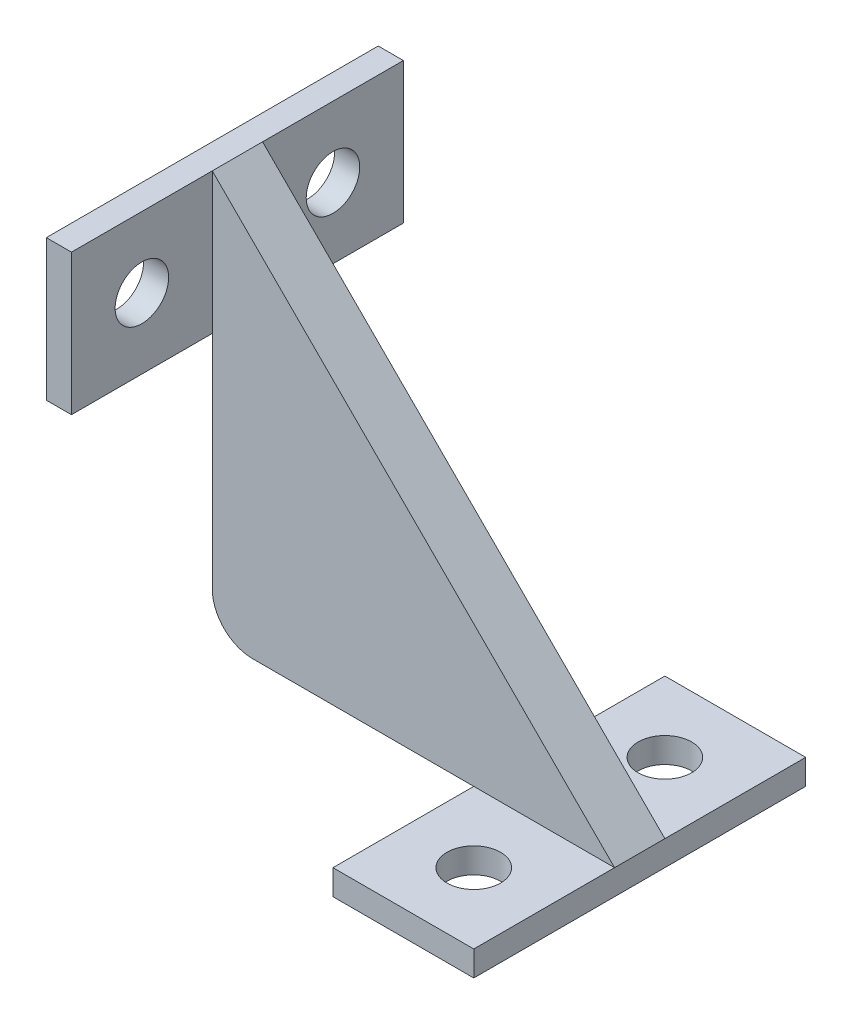
ISO-10303-21;
HEADER;
FILE_DESCRIPTION(('STEP AP214'),'2;1');
FILE_NAME('part.step','',(''),(''),'','','');
FILE_SCHEMA(('AUTOMOTIVE_DESIGN { 1 0 10303 214 1 1 1 1 }'));
ENDSEC;
DATA;
#1=APPLICATION_CONTEXT('core data for automotive mechanical design processes');
#2=APPLICATION_PROTOCOL_DEFINITION('international standard','automotive_design',2000,#1);
#3=PRODUCT_CONTEXT('',#1,'mechanical');
#4=PRODUCT('Part','Part','',(#3));
#5=PRODUCT_RELATED_PRODUCT_CATEGORY('part','',(#4));
#6=PRODUCT_DEFINITION_FORMATION('','',#4);
#7=PRODUCT_DEFINITION_CONTEXT('part definition',#1,'design');
#8=PRODUCT_DEFINITION('design','',#6,#7);
#9=PRODUCT_DEFINITION_SHAPE('','',#8);
#10=(LENGTH_UNIT() NAMED_UNIT(*) SI_UNIT(.MILLI.,.METRE.));
#11=(NAMED_UNIT(*) PLANE_ANGLE_UNIT() SI_UNIT($,.RADIAN.));
#12=(NAMED_UNIT(*) SI_UNIT($,.STERADIAN.) SOLID_ANGLE_UNIT());
#13=UNCERTAINTY_MEASURE_WITH_UNIT(LENGTH_MEASURE(1.E-05),#10,'distance_accuracy_value','');
#14=(GEOMETRIC_REPRESENTATION_CONTEXT(3) GLOBAL_UNCERTAINTY_ASSIGNED_CONTEXT((#13)) GLOBAL_UNIT_ASSIGNED_CONTEXT((#10,
#11,#12)) REPRESENTATION_CONTEXT('',''));
#15=CARTESIAN_POINT('',(0.,0.,0.));
#16=DIRECTION('',(0.,0.,1.));
#17=DIRECTION('',(1.,0.,0.));
#18=AXIS2_PLACEMENT_3D('',#15,#16,#17);
#19=CARTESIAN_POINT('',(50.8,0.,6.35));
#20=DIRECTION('',(0.,1.,0.));
#21=DIRECTION('',(-1.,0.,0.));
#22=AXIS2_PLACEMENT_3D('',#19,#20,#21);
#23=PLANE('',#22);
#24=DIRECTION('',(0.,0.,-1.));
#25=VECTOR('',#24,1.);
#26=CARTESIAN_POINT('',(33.02,0.,24.13));
#27=LINE('',#26,#25);
#28=CARTESIAN_POINT('',(33.02,0.,6.35));
#29=VERTEX_POINT('',#28);
#30=CARTESIAN_POINT('',(33.02,0.,0.));
#31=VERTEX_POINT('',#30);
#32=EDGE_CURVE('E59',#29,#31,#27,.T.);
#33=ORIENTED_EDGE('',*,*,#32,.F.);
#34=DIRECTION('',(1.,0.,0.));
#35=VECTOR('',#34,1.);
#36=CARTESIAN_POINT('',(50.8,0.,6.35));
#37=LINE('',#36,#35);
#38=CARTESIAN_POINT('',(5.08000000000004,0.,6.35));
#39=VERTEX_POINT('',#38);
#40=EDGE_CURVE('E225',#39,#29,#37,.T.);
#41=ORIENTED_EDGE('',*,*,#40,.F.);
#42=DIRECTION('',(0.,0.,-1.));
#43=VECTOR('',#42,1.);
#44=CARTESIAN_POINT('',(5.08000000000004,0.,6.35));
#45=LINE('',#44,#43);
#46=CARTESIAN_POINT('',(5.08000000000004,0.,0.));
#47=VERTEX_POINT('',#46);
#48=EDGE_CURVE('E239',#39,#47,#45,.T.);
#49=ORIENTED_EDGE('',*,*,#48,.T.);
#50=DIRECTION('',(1.,0.,0.));
#51=VECTOR('',#50,1.);
#52=CARTESIAN_POINT('',(50.8,0.,0.));
#53=LINE('',#52,#51);
#54=EDGE_CURVE('E219',#47,#31,#53,.T.);
#55=ORIENTED_EDGE('',*,*,#54,.T.);
#56=EDGE_LOOP('',(#33,#41,#49,#55));
#57=FACE_BOUND('',#56,.T.);
#58=ADVANCED_FACE('F44',(#57),#23,.F.);
#59=CARTESIAN_POINT('',(0.,5.08000000000004,6.35));
#60=DIRECTION('',(1.,0.,0.));
#61=DIRECTION('',(0.,0.,-1.));
#62=AXIS2_PLACEMENT_3D('',#59,#60,#61);
#63=PLANE('',#62);
#64=DIRECTION('',(0.,0.,1.));
#65=VECTOR('',#64,1.);
#66=CARTESIAN_POINT('',(0.,33.02,24.13));
#67=LINE('',#66,#65);
#68=CARTESIAN_POINT('',(0.,33.02,0.));
#69=VERTEX_POINT('',#68);
#70=CARTESIAN_POINT('',(0.,33.02,6.35));
#71=VERTEX_POINT('',#70);
#72=EDGE_CURVE('E199',#69,#71,#67,.T.);
#73=ORIENTED_EDGE('',*,*,#72,.F.);
#74=DIRECTION('',(0.,-1.,0.));
#75=VECTOR('',#74,1.);
#76=CARTESIAN_POINT('',(0.,5.08000000000004,0.));
#77=LINE('',#76,#75);
#78=CARTESIAN_POINT('',(0.,5.08000000000004,0.));
#79=VERTEX_POINT('',#78);
#80=EDGE_CURVE('E230',#69,#79,#77,.T.);
#81=ORIENTED_EDGE('',*,*,#80,.T.);
#82=DIRECTION('',(0.,0.,-1.));
#83=VECTOR('',#82,1.);
#84=CARTESIAN_POINT('',(0.,5.08000000000004,6.35));
#85=LINE('',#84,#83);
#86=CARTESIAN_POINT('',(0.,5.08000000000004,6.35));
#87=VERTEX_POINT('',#86);
#88=EDGE_CURVE('E52',#87,#79,#85,.T.);
#89=ORIENTED_EDGE('',*,*,#88,.F.);
#90=DIRECTION('',(0.,-1.,0.));
#91=VECTOR('',#90,1.);
#92=CARTESIAN_POINT('',(0.,5.08000000000004,6.35));
#93=LINE('',#92,#91);
#94=EDGE_CURVE('E218',#71,#87,#93,.T.);
#95=ORIENTED_EDGE('',*,*,#94,.F.);
#96=EDGE_LOOP('',(#73,#81,#89,#95));
#97=FACE_BOUND('',#96,.T.);
#98=ADVANCED_FACE('F299',(#97),#63,.F.);
#99=CARTESIAN_POINT('',(0.,50.8,6.35));
#100=DIRECTION('',(-0.707106781186548,-0.707106781186548,0.));
#101=DIRECTION('',(0.707106781186548,-0.707106781186548,0.));
#102=AXIS2_PLACEMENT_3D('',#99,#100,#101);
#103=PLANE('',#102);
#104=DIRECTION('',(-0.707106781186547,0.707106781186547,0.));
#105=VECTOR('',#104,1.);
#106=CARTESIAN_POINT('',(0.,50.8,0.));
#107=LINE('',#106,#105);
#108=CARTESIAN_POINT('',(50.8,0.,0.));
#109=VERTEX_POINT('',#108);
#110=CARTESIAN_POINT('',(0.,50.8,0.));
#111=VERTEX_POINT('',#110);
#112=EDGE_CURVE('E215',#109,#111,#107,.T.);
#113=ORIENTED_EDGE('',*,*,#112,.T.);
#114=DIRECTION('',(0.,0.,-1.));
#115=VECTOR('',#114,1.);
#116=CARTESIAN_POINT('',(0.,50.8,6.35));
#117=LINE('',#116,#115);
#118=CARTESIAN_POINT('',(0.,50.8,6.35));
#119=VERTEX_POINT('',#118);
#120=EDGE_CURVE('E11',#119,#111,#117,.T.);
#121=ORIENTED_EDGE('',*,*,#120,.F.);
#122=DIRECTION('',(-0.707106781186547,0.707106781186547,0.));
#123=VECTOR('',#122,1.);
#124=CARTESIAN_POINT('',(0.,50.8,6.35));
#125=LINE('',#124,#123);
#126=CARTESIAN_POINT('',(50.8,0.,6.35));
#127=VERTEX_POINT('',#126);
#128=EDGE_CURVE('E216',#127,#119,#125,.T.);
#129=ORIENTED_EDGE('',*,*,#128,.F.);
#130=DIRECTION('',(0.,0.,-1.));
#131=VECTOR('',#130,1.);
#132=CARTESIAN_POINT('',(50.8,0.,6.35));
#133=LINE('',#132,#131);
#134=EDGE_CURVE('E227',#127,#109,#133,.T.);
#135=ORIENTED_EDGE('',*,*,#134,.T.);
#136=EDGE_LOOP('',(#113,#121,#129,#135));
#137=FACE_BOUND('',#136,.T.);
#138=ADVANCED_FACE('F46',(#137),#103,.F.);
#139=CARTESIAN_POINT('',(5.08,5.08,6.35));
#140=DIRECTION('',(0.,0.,-1.));
#141=DIRECTION('',(-1.,0.,0.));
#142=AXIS2_PLACEMENT_3D('',#139,#140,#141);
#143=CYLINDRICAL_SURFACE('',#142,5.08);
#144=CARTESIAN_POINT('',(5.08,5.08,0.));
#145=DIRECTION('',(0.,0.,1.));
#146=DIRECTION('',(1.,0.,0.));
#147=AXIS2_PLACEMENT_3D('',#144,#145,#146);
#148=CIRCLE('',#147,5.08);
#149=EDGE_CURVE('E234',#79,#47,#148,.T.);
#150=ORIENTED_EDGE('',*,*,#149,.T.);
#151=ORIENTED_EDGE('',*,*,#48,.F.);
#152=CARTESIAN_POINT('',(5.08,5.08,6.35));
#153=DIRECTION('',(0.,0.,1.));
#154=DIRECTION('',(1.,0.,0.));
#155=AXIS2_PLACEMENT_3D('',#152,#153,#154);
#156=CIRCLE('',#155,5.08);
#157=EDGE_CURVE('E223',#87,#39,#156,.T.);
#158=ORIENTED_EDGE('',*,*,#157,.F.);
#159=ORIENTED_EDGE('',*,*,#88,.T.);
#160=EDGE_LOOP('',(#150,#151,#158,#159));
#161=FACE_BOUND('',#160,.T.);
#162=ADVANCED_FACE('F246',(#161),#143,.T.);
#163=CARTESIAN_POINT('',(5.08,5.08,6.35));
#164=DIRECTION('',(0.,0.,1.));
#165=DIRECTION('',(1.,0.,0.));
#166=AXIS2_PLACEMENT_3D('',#163,#164,#165);
#167=PLANE('',#166);
#168=ORIENTED_EDGE('',*,*,#128,.T.);
#169=EDGE_CURVE('E220',#119,#71,#93,.T.);
#170=ORIENTED_EDGE('',*,*,#169,.T.);
#171=ORIENTED_EDGE('',*,*,#94,.T.);
#172=ORIENTED_EDGE('',*,*,#157,.T.);
#173=ORIENTED_EDGE('',*,*,#40,.T.);
#174=DIRECTION('',(1.,0.,0.));
#175=VECTOR('',#174,1.);
#176=CARTESIAN_POINT('',(5.08,0.,6.35));
#177=LINE('',#176,#175);
#178=EDGE_CURVE('E173',#29,#127,#177,.T.);
#179=ORIENTED_EDGE('',*,*,#178,.T.);
#180=EDGE_LOOP('',(#168,#170,#171,#172,#173,#179));
#181=FACE_BOUND('',#180,.T.);
#182=ADVANCED_FACE('F277',(#181),#167,.T.);
#183=CARTESIAN_POINT('',(5.08,5.08,0.));
#184=DIRECTION('',(0.,0.,1.));
#185=DIRECTION('',(1.,0.,0.));
#186=AXIS2_PLACEMENT_3D('',#183,#184,#185);
#187=PLANE('',#186);
#188=ORIENTED_EDGE('',*,*,#112,.F.);
#189=EDGE_CURVE('E67',#31,#109,#53,.T.);
#190=ORIENTED_EDGE('',*,*,#189,.F.);
#191=ORIENTED_EDGE('',*,*,#54,.F.);
#192=ORIENTED_EDGE('',*,*,#149,.F.);
#193=ORIENTED_EDGE('',*,*,#80,.F.);
#194=EDGE_CURVE('E231',#111,#69,#77,.T.);
#195=ORIENTED_EDGE('',*,*,#194,.F.);
#196=EDGE_LOOP('',(#188,#190,#191,#192,#193,#195));
#197=FACE_BOUND('',#196,.T.);
#198=ADVANCED_FACE('F249',(#197),#187,.F.);
#199=CARTESIAN_POINT('',(0.,0.,0.));
#200=DIRECTION('',(1.,0.,0.));
#201=DIRECTION('',(0.,0.,-1.));
#202=AXIS2_PLACEMENT_3D('',#199,#200,#201);
#203=PLANE('',#202);
#204=CARTESIAN_POINT('',(0.,41.91,-8.89));
#205=DIRECTION('',(1.,0.,0.));
#206=DIRECTION('',(0.,0.,1.));
#207=AXIS2_PLACEMENT_3D('',#204,#205,#206);
#208=CIRCLE('',#207,3.3782);
#209=CARTESIAN_POINT('',(0.,41.91,-5.5118));
#210=VERTEX_POINT('',#209);
#211=EDGE_CURVE('E511',#210,#210,#208,.T.);
#212=ORIENTED_EDGE('',*,*,#211,.F.);
#213=EDGE_LOOP('',(#212));
#214=FACE_BOUND('',#213,.T.);
#215=ORIENTED_EDGE('',*,*,#194,.T.);
#216=CARTESIAN_POINT('',(0.,33.02,-17.78));
#217=VERTEX_POINT('',#216);
#218=EDGE_CURVE('E195',#217,#69,#67,.T.);
#219=ORIENTED_EDGE('',*,*,#218,.F.);
#220=DIRECTION('',(0.,-1.,0.));
#221=VECTOR('',#220,1.);
#222=CARTESIAN_POINT('',(0.,33.02,-17.78));
#223=LINE('',#222,#221);
#224=CARTESIAN_POINT('',(0.,50.8,-17.78));
#225=VERTEX_POINT('',#224);
#226=EDGE_CURVE('E175',#225,#217,#223,.T.);
#227=ORIENTED_EDGE('',*,*,#226,.F.);
#228=DIRECTION('',(0.,0.,-1.));
#229=VECTOR('',#228,1.);
#230=CARTESIAN_POINT('',(0.,50.8,-17.78));
#231=LINE('',#230,#229);
#232=EDGE_CURVE('E201',#111,#225,#231,.T.);
#233=ORIENTED_EDGE('',*,*,#232,.F.);
#234=EDGE_LOOP('',(#215,#219,#227,#233));
#235=FACE_BOUND('',#234,.T.);
#236=ADVANCED_FACE('F301',(#214,#235),#203,.T.);
#237=CARTESIAN_POINT('',(-3.175,33.02,-17.78));
#238=DIRECTION('',(0.,0.,1.));
#239=DIRECTION('',(1.,0.,0.));
#240=AXIS2_PLACEMENT_3D('',#237,#238,#239);
#241=PLANE('',#240);
#242=ORIENTED_EDGE('',*,*,#226,.T.);
#243=DIRECTION('',(1.,0.,0.));
#244=VECTOR('',#243,1.);
#245=CARTESIAN_POINT('',(-3.175,33.02,-17.78));
#246=LINE('',#245,#244);
#247=CARTESIAN_POINT('',(-3.175,33.02,-17.78));
#248=VERTEX_POINT('',#247);
#249=EDGE_CURVE('E212',#248,#217,#246,.T.);
#250=ORIENTED_EDGE('',*,*,#249,.F.);
#251=DIRECTION('',(0.,-1.,0.));
#252=VECTOR('',#251,1.);
#253=CARTESIAN_POINT('',(-3.175,33.02,-17.78));
#254=LINE('',#253,#252);
#255=CARTESIAN_POINT('',(-3.175,50.8,-17.78));
#256=VERTEX_POINT('',#255);
#257=EDGE_CURVE('E181',#256,#248,#254,.T.);
#258=ORIENTED_EDGE('',*,*,#257,.F.);
#259=DIRECTION('',(1.,0.,0.));
#260=VECTOR('',#259,1.);
#261=CARTESIAN_POINT('',(-3.175,50.8,-17.78));
#262=LINE('',#261,#260);
#263=EDGE_CURVE('E191',#256,#225,#262,.T.);
#264=ORIENTED_EDGE('',*,*,#263,.T.);
#265=EDGE_LOOP('',(#242,#250,#258,#264));
#266=FACE_BOUND('',#265,.T.);
#267=ADVANCED_FACE('F305',(#266),#241,.F.);
#268=CARTESIAN_POINT('',(-3.175,33.02,24.13));
#269=DIRECTION('',(0.,1.,0.));
#270=DIRECTION('',(0.,0.,1.));
#271=AXIS2_PLACEMENT_3D('',#268,#269,#270);
#272=PLANE('',#271);
#273=ORIENTED_EDGE('',*,*,#218,.T.);
#274=ORIENTED_EDGE('',*,*,#72,.T.);
#275=CARTESIAN_POINT('',(0.,33.02,24.13));
#276=VERTEX_POINT('',#275);
#277=EDGE_CURVE('E194',#71,#276,#67,.T.);
#278=ORIENTED_EDGE('',*,*,#277,.T.);
#279=DIRECTION('',(1.,0.,0.));
#280=VECTOR('',#279,1.);
#281=CARTESIAN_POINT('',(-3.175,33.02,24.13));
#282=LINE('',#281,#280);
#283=CARTESIAN_POINT('',(-3.175,33.02,24.13));
#284=VERTEX_POINT('',#283);
#285=EDGE_CURVE('E209',#284,#276,#282,.T.);
#286=ORIENTED_EDGE('',*,*,#285,.F.);
#287=DIRECTION('',(0.,0.,1.));
#288=VECTOR('',#287,1.);
#289=CARTESIAN_POINT('',(-3.175,33.02,24.13));
#290=LINE('',#289,#288);
#291=EDGE_CURVE('E184',#248,#284,#290,.T.);
#292=ORIENTED_EDGE('',*,*,#291,.F.);
#293=ORIENTED_EDGE('',*,*,#249,.T.);
#294=EDGE_LOOP('',(#273,#274,#278,#286,#292,#293));
#295=FACE_BOUND('',#294,.T.);
#296=ADVANCED_FACE('F298',(#295),#272,.F.);
#297=CARTESIAN_POINT('',(-3.175,50.8,24.13));
#298=DIRECTION('',(0.,0.,-1.));
#299=DIRECTION('',(-1.,0.,0.));
#300=AXIS2_PLACEMENT_3D('',#297,#298,#299);
#301=PLANE('',#300);
#302=DIRECTION('',(0.,1.,0.));
#303=VECTOR('',#302,1.);
#304=CARTESIAN_POINT('',(0.,50.8,24.13));
#305=LINE('',#304,#303);
#306=CARTESIAN_POINT('',(0.,50.8,24.13));
#307=VERTEX_POINT('',#306);
#308=EDGE_CURVE('E198',#276,#307,#305,.T.);
#309=ORIENTED_EDGE('',*,*,#308,.T.);
#310=DIRECTION('',(1.,0.,0.));
#311=VECTOR('',#310,1.);
#312=CARTESIAN_POINT('',(-3.175,50.8,24.13));
#313=LINE('',#312,#311);
#314=CARTESIAN_POINT('',(-3.175,50.8,24.13));
#315=VERTEX_POINT('',#314);
#316=EDGE_CURVE('E206',#315,#307,#313,.T.);
#317=ORIENTED_EDGE('',*,*,#316,.F.);
#318=DIRECTION('',(0.,1.,0.));
#319=VECTOR('',#318,1.);
#320=CARTESIAN_POINT('',(-3.175,50.8,24.13));
#321=LINE('',#320,#319);
#322=EDGE_CURVE('E187',#284,#315,#321,.T.);
#323=ORIENTED_EDGE('',*,*,#322,.F.);
#324=ORIENTED_EDGE('',*,*,#285,.T.);
#325=EDGE_LOOP('',(#309,#317,#323,#324));
#326=FACE_BOUND('',#325,.T.);
#327=ADVANCED_FACE('F295',(#326),#301,.F.);
#328=CARTESIAN_POINT('',(-3.175,50.8,-17.78));
#329=DIRECTION('',(0.,-1.,0.));
#330=DIRECTION('',(0.,0.,-1.));
#331=AXIS2_PLACEMENT_3D('',#328,#329,#330);
#332=PLANE('',#331);
#333=EDGE_CURVE('E185',#307,#119,#231,.T.);
#334=ORIENTED_EDGE('',*,*,#333,.T.);
#335=ORIENTED_EDGE('',*,*,#120,.T.);
#336=ORIENTED_EDGE('',*,*,#232,.T.);
#337=ORIENTED_EDGE('',*,*,#263,.F.);
#338=DIRECTION('',(0.,0.,-1.));
#339=VECTOR('',#338,1.);
#340=CARTESIAN_POINT('',(-3.175,50.8,-17.78));
#341=LINE('',#340,#339);
#342=EDGE_CURVE('E189',#315,#256,#341,.T.);
#343=ORIENTED_EDGE('',*,*,#342,.F.);
#344=ORIENTED_EDGE('',*,*,#316,.T.);
#345=EDGE_LOOP('',(#334,#335,#336,#337,#343,#344));
#346=FACE_BOUND('',#345,.T.);
#347=ADVANCED_FACE('F289',(#346),#332,.F.);
#348=CARTESIAN_POINT('',(-3.175,0.,0.));
#349=DIRECTION('',(1.,0.,0.));
#350=DIRECTION('',(0.,0.,-1.));
#351=AXIS2_PLACEMENT_3D('',#348,#349,#350);
#352=PLANE('',#351);
#353=CARTESIAN_POINT('',(-3.175,41.91,15.24));
#354=DIRECTION('',(1.,0.,0.));
#355=DIRECTION('',(0.,0.,-1.));
#356=AXIS2_PLACEMENT_3D('',#353,#354,#355);
#357=CIRCLE('',#356,3.3782);
#358=CARTESIAN_POINT('',(-3.175,41.91,11.8618));
#359=VERTEX_POINT('',#358);
#360=EDGE_CURVE('E515',#359,#359,#357,.T.);
#361=ORIENTED_EDGE('',*,*,#360,.T.);
#362=EDGE_LOOP('',(#361));
#363=FACE_BOUND('',#362,.T.);
#364=CARTESIAN_POINT('',(-3.175,41.91,-8.89));
#365=DIRECTION('',(1.,0.,0.));
#366=DIRECTION('',(0.,0.,1.));
#367=AXIS2_PLACEMENT_3D('',#364,#365,#366);
#368=CIRCLE('',#367,3.3782);
#369=CARTESIAN_POINT('',(-3.175,41.91,-5.5118));
#370=VERTEX_POINT('',#369);
#371=EDGE_CURVE('E508',#370,#370,#368,.T.);
#372=ORIENTED_EDGE('',*,*,#371,.T.);
#373=EDGE_LOOP('',(#372));
#374=FACE_BOUND('',#373,.T.);
#375=ORIENTED_EDGE('',*,*,#257,.T.);
#376=ORIENTED_EDGE('',*,*,#291,.T.);
#377=ORIENTED_EDGE('',*,*,#322,.T.);
#378=ORIENTED_EDGE('',*,*,#342,.T.);
#379=EDGE_LOOP('',(#375,#376,#377,#378));
#380=FACE_BOUND('',#379,.T.);
#381=ADVANCED_FACE('F308',(#363,#374,#380),#352,.F.);
#382=CARTESIAN_POINT('',(0.,41.91,15.24));
#383=DIRECTION('',(1.,0.,0.));
#384=DIRECTION('',(0.,0.,-1.));
#385=AXIS2_PLACEMENT_3D('',#382,#383,#384);
#386=CIRCLE('',#385,3.3782);
#387=CARTESIAN_POINT('',(0.,41.91,11.8618));
#388=VERTEX_POINT('',#387);
#389=EDGE_CURVE('E512',#388,#388,#386,.T.);
#390=ORIENTED_EDGE('',*,*,#389,.F.);
#391=EDGE_LOOP('',(#390));
#392=FACE_BOUND('',#391,.T.);
#393=ORIENTED_EDGE('',*,*,#277,.F.);
#394=ORIENTED_EDGE('',*,*,#169,.F.);
#395=ORIENTED_EDGE('',*,*,#333,.F.);
#396=ORIENTED_EDGE('',*,*,#308,.F.);
#397=EDGE_LOOP('',(#393,#394,#395,#396));
#398=FACE_BOUND('',#397,.T.);
#399=ADVANCED_FACE('F286',(#392,#398),#203,.T.);
#400=CARTESIAN_POINT('',(0.,0.,0.));
#401=DIRECTION('',(0.,-1.,0.));
#402=DIRECTION('',(1.,0.,0.));
#403=AXIS2_PLACEMENT_3D('',#400,#401,#402);
#404=PLANE('',#403);
#405=CARTESIAN_POINT('',(41.91,0.,-8.89));
#406=DIRECTION('',(0.,1.,0.));
#407=DIRECTION('',(-1.,0.,0.));
#408=AXIS2_PLACEMENT_3D('',#405,#406,#407);
#409=CIRCLE('',#408,3.3782);
#410=CARTESIAN_POINT('',(38.5318,0.,-8.89));
#411=VERTEX_POINT('',#410);
#412=EDGE_CURVE('E523',#411,#411,#409,.T.);
#413=ORIENTED_EDGE('',*,*,#412,.F.);
#414=EDGE_LOOP('',(#413));
#415=FACE_BOUND('',#414,.T.);
#416=CARTESIAN_POINT('',(33.02,0.,-17.78));
#417=VERTEX_POINT('',#416);
#418=EDGE_CURVE('E253',#31,#417,#27,.T.);
#419=ORIENTED_EDGE('',*,*,#418,.F.);
#420=ORIENTED_EDGE('',*,*,#189,.T.);
#421=DIRECTION('',(0.,0.,1.));
#422=VECTOR('',#421,1.);
#423=CARTESIAN_POINT('',(50.8,0.,-17.78));
#424=LINE('',#423,#422);
#425=CARTESIAN_POINT('',(50.8,0.,-17.78));
#426=VERTEX_POINT('',#425);
#427=EDGE_CURVE('E534',#426,#109,#424,.T.);
#428=ORIENTED_EDGE('',*,*,#427,.F.);
#429=DIRECTION('',(1.,0.,0.));
#430=VECTOR('',#429,1.);
#431=CARTESIAN_POINT('',(33.02,0.,-17.78));
#432=LINE('',#431,#430);
#433=EDGE_CURVE('E172',#417,#426,#432,.T.);
#434=ORIENTED_EDGE('',*,*,#433,.F.);
#435=EDGE_LOOP('',(#419,#420,#428,#434));
#436=FACE_BOUND('',#435,.T.);
#437=ADVANCED_FACE('F254',(#415,#436),#404,.F.);
#438=CARTESIAN_POINT('',(33.02,-3.175,-17.78));
#439=DIRECTION('',(0.,0.,1.));
#440=DIRECTION('',(1.,0.,0.));
#441=AXIS2_PLACEMENT_3D('',#438,#439,#440);
#442=PLANE('',#441);
#443=ORIENTED_EDGE('',*,*,#433,.T.);
#444=DIRECTION('',(0.,1.,0.));
#445=VECTOR('',#444,1.);
#446=CARTESIAN_POINT('',(50.8,-3.175,-17.78));
#447=LINE('',#446,#445);
#448=CARTESIAN_POINT('',(50.8,-3.175,-17.78));
#449=VERTEX_POINT('',#448);
#450=EDGE_CURVE('E152',#449,#426,#447,.T.);
#451=ORIENTED_EDGE('',*,*,#450,.F.);
#452=DIRECTION('',(1.,0.,0.));
#453=VECTOR('',#452,1.);
#454=CARTESIAN_POINT('',(33.02,-3.175,-17.78));
#455=LINE('',#454,#453);
#456=CARTESIAN_POINT('',(33.02,-3.175,-17.78));
#457=VERTEX_POINT('',#456);
#458=EDGE_CURVE('E159',#457,#449,#455,.T.);
#459=ORIENTED_EDGE('',*,*,#458,.F.);
#460=DIRECTION('',(0.,1.,0.));
#461=VECTOR('',#460,1.);
#462=CARTESIAN_POINT('',(33.02,-3.175,-17.78));
#463=LINE('',#462,#461);
#464=EDGE_CURVE('E265',#457,#417,#463,.T.);
#465=ORIENTED_EDGE('',*,*,#464,.T.);
#466=EDGE_LOOP('',(#443,#451,#459,#465));
#467=FACE_BOUND('',#466,.T.);
#468=ADVANCED_FACE('F170',(#467),#442,.F.);
#469=CARTESIAN_POINT('',(50.8,-3.175,-17.78));
#470=DIRECTION('',(-1.,0.,0.));
#471=DIRECTION('',(0.,-1.,0.));
#472=AXIS2_PLACEMENT_3D('',#469,#470,#471);
#473=PLANE('',#472);
#474=ORIENTED_EDGE('',*,*,#427,.T.);
#475=ORIENTED_EDGE('',*,*,#134,.F.);
#476=CARTESIAN_POINT('',(50.8,0.,24.13));
#477=VERTEX_POINT('',#476);
#478=EDGE_CURVE('E273',#127,#477,#424,.T.);
#479=ORIENTED_EDGE('',*,*,#478,.T.);
#480=DIRECTION('',(0.,1.,0.));
#481=VECTOR('',#480,1.);
#482=CARTESIAN_POINT('',(50.8,-3.175,24.13));
#483=LINE('',#482,#481);
#484=CARTESIAN_POINT('',(50.8,-3.175,24.13));
#485=VERTEX_POINT('',#484);
#486=EDGE_CURVE('E155',#485,#477,#483,.T.);
#487=ORIENTED_EDGE('',*,*,#486,.F.);
#488=DIRECTION('',(0.,0.,1.));
#489=VECTOR('',#488,1.);
#490=CARTESIAN_POINT('',(50.8,-3.175,-17.78));
#491=LINE('',#490,#489);
#492=EDGE_CURVE('E147',#449,#485,#491,.T.);
#493=ORIENTED_EDGE('',*,*,#492,.F.);
#494=ORIENTED_EDGE('',*,*,#450,.T.);
#495=EDGE_LOOP('',(#474,#475,#479,#487,#493,#494));
#496=FACE_BOUND('',#495,.T.);
#497=ADVANCED_FACE('F150',(#496),#473,.F.);
#498=CARTESIAN_POINT('',(50.8,-3.175,24.13));
#499=DIRECTION('',(0.,0.,-1.));
#500=DIRECTION('',(-1.,0.,0.));
#501=AXIS2_PLACEMENT_3D('',#498,#499,#500);
#502=PLANE('',#501);
#503=DIRECTION('',(-1.,0.,0.));
#504=VECTOR('',#503,1.);
#505=CARTESIAN_POINT('',(50.8,0.,24.13));
#506=LINE('',#505,#504);
#507=CARTESIAN_POINT('',(33.02,0.,24.13));
#508=VERTEX_POINT('',#507);
#509=EDGE_CURVE('E256',#477,#508,#506,.T.);
#510=ORIENTED_EDGE('',*,*,#509,.T.);
#511=DIRECTION('',(0.,1.,0.));
#512=VECTOR('',#511,1.);
#513=CARTESIAN_POINT('',(33.02,-3.175,24.13));
#514=LINE('',#513,#512);
#515=CARTESIAN_POINT('',(33.02,-3.175,24.13));
#516=VERTEX_POINT('',#515);
#517=EDGE_CURVE('E177',#516,#508,#514,.T.);
#518=ORIENTED_EDGE('',*,*,#517,.F.);
#519=DIRECTION('',(-1.,0.,0.));
#520=VECTOR('',#519,1.);
#521=CARTESIAN_POINT('',(50.8,-3.175,24.13));
#522=LINE('',#521,#520);
#523=EDGE_CURVE('E158',#485,#516,#522,.T.);
#524=ORIENTED_EDGE('',*,*,#523,.F.);
#525=ORIENTED_EDGE('',*,*,#486,.T.);
#526=EDGE_LOOP('',(#510,#518,#524,#525));
#527=FACE_BOUND('',#526,.T.);
#528=ADVANCED_FACE('F364',(#527),#502,.F.);
#529=CARTESIAN_POINT('',(33.02,-3.175,24.13));
#530=DIRECTION('',(1.,0.,0.));
#531=DIRECTION('',(0.,0.,-1.));
#532=AXIS2_PLACEMENT_3D('',#529,#530,#531);
#533=PLANE('',#532);
#534=EDGE_CURVE('E168',#508,#29,#27,.T.);
#535=ORIENTED_EDGE('',*,*,#534,.T.);
#536=ORIENTED_EDGE('',*,*,#32,.T.);
#537=ORIENTED_EDGE('',*,*,#418,.T.);
#538=ORIENTED_EDGE('',*,*,#464,.F.);
#539=DIRECTION('',(0.,0.,-1.));
#540=VECTOR('',#539,1.);
#541=CARTESIAN_POINT('',(33.02,-3.175,24.13));
#542=LINE('',#541,#540);
#543=EDGE_CURVE('E164',#516,#457,#542,.T.);
#544=ORIENTED_EDGE('',*,*,#543,.F.);
#545=ORIENTED_EDGE('',*,*,#517,.T.);
#546=EDGE_LOOP('',(#535,#536,#537,#538,#544,#545));
#547=FACE_BOUND('',#546,.T.);
#548=ADVANCED_FACE('F259',(#547),#533,.F.);
#549=CARTESIAN_POINT('',(0.,-3.175,0.));
#550=DIRECTION('',(0.,-1.,0.));
#551=DIRECTION('',(1.,0.,0.));
#552=AXIS2_PLACEMENT_3D('',#549,#550,#551);
#553=PLANE('',#552);
#554=CARTESIAN_POINT('',(41.91,-3.175,-8.89));
#555=DIRECTION('',(0.,1.,0.));
#556=DIRECTION('',(-1.,0.,0.));
#557=AXIS2_PLACEMENT_3D('',#554,#555,#556);
#558=CIRCLE('',#557,3.3782);
#559=CARTESIAN_POINT('',(38.5318,-3.175,-8.89));
#560=VERTEX_POINT('',#559);
#561=EDGE_CURVE('E520',#560,#560,#558,.T.);
#562=ORIENTED_EDGE('',*,*,#561,.T.);
#563=EDGE_LOOP('',(#562));
#564=FACE_BOUND('',#563,.T.);
#565=CARTESIAN_POINT('',(41.91,-3.175,15.24));
#566=DIRECTION('',(0.,1.,0.));
#567=DIRECTION('',(1.,0.,0.));
#568=AXIS2_PLACEMENT_3D('',#565,#566,#567);
#569=CIRCLE('',#568,3.3782);
#570=CARTESIAN_POINT('',(45.2882,-3.175,15.24));
#571=VERTEX_POINT('',#570);
#572=EDGE_CURVE('E529',#571,#571,#569,.T.);
#573=ORIENTED_EDGE('',*,*,#572,.T.);
#574=EDGE_LOOP('',(#573));
#575=FACE_BOUND('',#574,.T.);
#576=ORIENTED_EDGE('',*,*,#458,.T.);
#577=ORIENTED_EDGE('',*,*,#492,.T.);
#578=ORIENTED_EDGE('',*,*,#523,.T.);
#579=ORIENTED_EDGE('',*,*,#543,.T.);
#580=EDGE_LOOP('',(#576,#577,#578,#579));
#581=FACE_BOUND('',#580,.T.);
#582=ADVANCED_FACE('F162',(#564,#575,#581),#553,.T.);
#583=CARTESIAN_POINT('',(41.91,0.,15.24));
#584=DIRECTION('',(0.,1.,0.));
#585=DIRECTION('',(1.,0.,0.));
#586=AXIS2_PLACEMENT_3D('',#583,#584,#585);
#587=CIRCLE('',#586,3.3782);
#588=CARTESIAN_POINT('',(45.2882,0.,15.24));
#589=VERTEX_POINT('',#588);
#590=EDGE_CURVE('E526',#589,#589,#587,.T.);
#591=ORIENTED_EDGE('',*,*,#590,.F.);
#592=EDGE_LOOP('',(#591));
#593=FACE_BOUND('',#592,.T.);
#594=ORIENTED_EDGE('',*,*,#178,.F.);
#595=ORIENTED_EDGE('',*,*,#534,.F.);
#596=ORIENTED_EDGE('',*,*,#509,.F.);
#597=ORIENTED_EDGE('',*,*,#478,.F.);
#598=EDGE_LOOP('',(#594,#595,#596,#597));
#599=FACE_BOUND('',#598,.T.);
#600=ADVANCED_FACE('F271',(#593,#599),#404,.F.);
#601=CARTESIAN_POINT('',(41.91,-3.175,15.24));
#602=DIRECTION('',(0.,1.,0.));
#603=DIRECTION('',(-1.,0.,0.));
#604=AXIS2_PLACEMENT_3D('',#601,#602,#603);
#605=CYLINDRICAL_SURFACE('',#604,3.3782);
#606=ORIENTED_EDGE('',*,*,#572,.F.);
#607=EDGE_LOOP('',(#606));
#608=FACE_BOUND('',#607,.T.);
#609=ORIENTED_EDGE('',*,*,#590,.T.);
#610=EDGE_LOOP('',(#609));
#611=FACE_BOUND('',#610,.T.);
#612=ADVANCED_FACE('F402',(#608,#611),#605,.F.);
#613=CARTESIAN_POINT('',(41.91,-3.175,-8.89));
#614=DIRECTION('',(0.,1.,0.));
#615=DIRECTION('',(-1.,0.,0.));
#616=AXIS2_PLACEMENT_3D('',#613,#614,#615);
#617=CYLINDRICAL_SURFACE('',#616,3.3782);
#618=ORIENTED_EDGE('',*,*,#561,.F.);
#619=EDGE_LOOP('',(#618));
#620=FACE_BOUND('',#619,.T.);
#621=ORIENTED_EDGE('',*,*,#412,.T.);
#622=EDGE_LOOP('',(#621));
#623=FACE_BOUND('',#622,.T.);
#624=ADVANCED_FACE('F410',(#620,#623),#617,.F.);
#625=CARTESIAN_POINT('',(-3.175,41.91,15.24));
#626=DIRECTION('',(1.,0.,0.));
#627=DIRECTION('',(0.,0.,-1.));
#628=AXIS2_PLACEMENT_3D('',#625,#626,#627);
#629=CYLINDRICAL_SURFACE('',#628,3.3782);
#630=ORIENTED_EDGE('',*,*,#360,.F.);
#631=EDGE_LOOP('',(#630));
#632=FACE_BOUND('',#631,.T.);
#633=ORIENTED_EDGE('',*,*,#389,.T.);
#634=EDGE_LOOP('',(#633));
#635=FACE_BOUND('',#634,.T.);
#636=ADVANCED_FACE('F418',(#632,#635),#629,.F.);
#637=CARTESIAN_POINT('',(-3.175,41.91,-8.89));
#638=DIRECTION('',(1.,0.,0.));
#639=DIRECTION('',(0.,0.,-1.));
#640=AXIS2_PLACEMENT_3D('',#637,#638,#639);
#641=CYLINDRICAL_SURFACE('',#640,3.3782);
#642=ORIENTED_EDGE('',*,*,#371,.F.);
#643=EDGE_LOOP('',(#642));
#644=FACE_BOUND('',#643,.T.);
#645=ORIENTED_EDGE('',*,*,#211,.T.);
#646=EDGE_LOOP('',(#645));
#647=FACE_BOUND('',#646,.T.);
#648=ADVANCED_FACE('F491',(#644,#647),#641,.F.);
#649=CLOSED_SHELL('',(#58,#98,#138,#162,#182,#198,#236,#267,#296,#327,#347,#381,#399,#437,#468,
#497,#528,#548,#582,#600,#612,#624,#636,#648));
#650=MANIFOLD_SOLID_BREP('B2',#649);
#651=ADVANCED_BREP_SHAPE_REPRESENTATION('',(#18,#650),#14);
#652=SHAPE_DEFINITION_REPRESENTATION(#9,#651);
ENDSEC;
END-ISO-10303-21;
